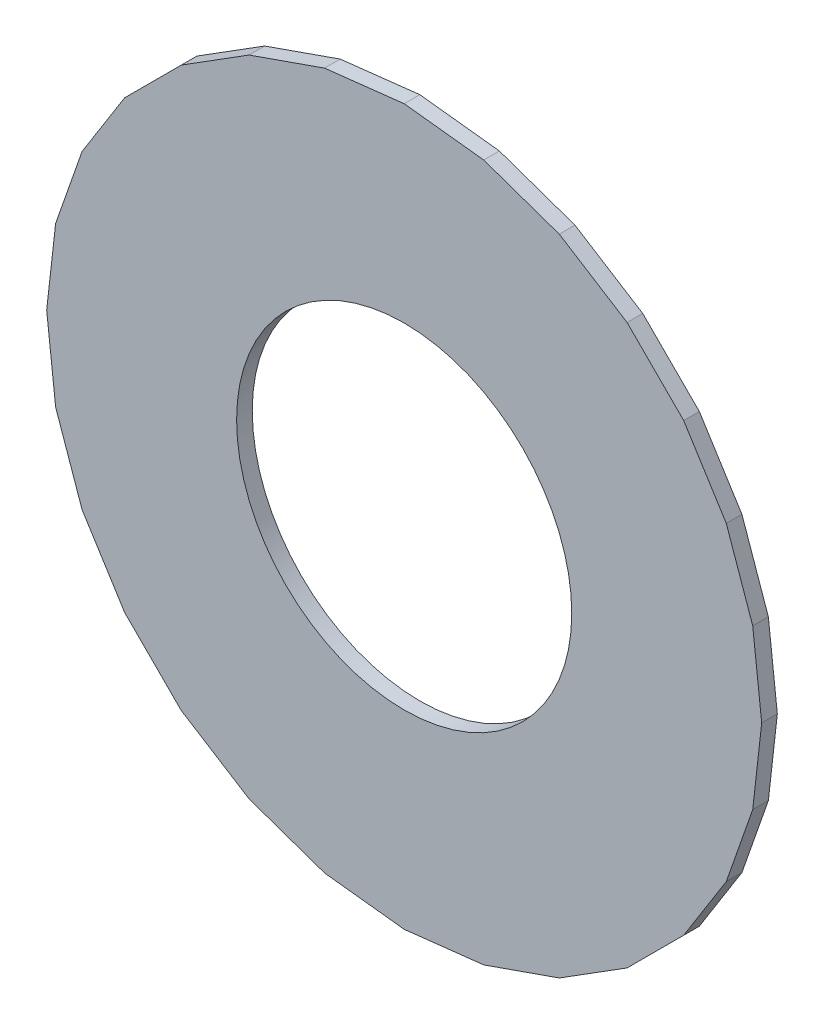
ISO-10303-21;
HEADER;
FILE_DESCRIPTION(('STEP AP214'),'2;1');
FILE_NAME('part.step','',(''),(''),'','','');
FILE_SCHEMA(('AUTOMOTIVE_DESIGN { 1 0 10303 214 1 1 1 1 }'));
ENDSEC;
DATA;
#1=APPLICATION_CONTEXT('core data for automotive mechanical design processes');
#2=APPLICATION_PROTOCOL_DEFINITION('international standard','automotive_design',2000,#1);
#3=PRODUCT_CONTEXT('',#1,'mechanical');
#4=PRODUCT('Part','Part','',(#3));
#5=PRODUCT_RELATED_PRODUCT_CATEGORY('part','',(#4));
#6=PRODUCT_DEFINITION_FORMATION('','',#4);
#7=PRODUCT_DEFINITION_CONTEXT('part definition',#1,'design');
#8=PRODUCT_DEFINITION('design','',#6,#7);
#9=PRODUCT_DEFINITION_SHAPE('','',#8);
#10=(LENGTH_UNIT() NAMED_UNIT(*) SI_UNIT(.MILLI.,.METRE.));
#11=(NAMED_UNIT(*) PLANE_ANGLE_UNIT() SI_UNIT($,.RADIAN.));
#12=(NAMED_UNIT(*) SI_UNIT($,.STERADIAN.) SOLID_ANGLE_UNIT());
#13=UNCERTAINTY_MEASURE_WITH_UNIT(LENGTH_MEASURE(1.E-05),#10,'distance_accuracy_value','');
#14=(GEOMETRIC_REPRESENTATION_CONTEXT(3) GLOBAL_UNCERTAINTY_ASSIGNED_CONTEXT((#13)) GLOBAL_UNIT_ASSIGNED_CONTEXT((#10,
#11,#12)) REPRESENTATION_CONTEXT('',''));
#15=CARTESIAN_POINT('',(0.,0.,0.));
#16=DIRECTION('',(0.,0.,1.));
#17=DIRECTION('',(1.,0.,0.));
#18=AXIS2_PLACEMENT_3D('',#15,#16,#17);
#19=CARTESIAN_POINT('',(166.497,-143.637,-0.045));
#20=DIRECTION('',(0.,0.,-1.));
#21=DIRECTION('',(0.,-1.,0.));
#22=AXIS2_PLACEMENT_3D('',#19,#20,#21);
#23=CYLINDRICAL_SURFACE('',#22,0.375);
#24=CARTESIAN_POINT('',(166.497,-143.637,1.67));
#25=DIRECTION('',(0.,0.,-1.));
#26=DIRECTION('',(0.,-1.,0.));
#27=AXIS2_PLACEMENT_3D('',#24,#25,#26);
#28=CIRCLE('',#27,0.375);
#29=CARTESIAN_POINT('',(166.497,-144.012,1.67));
#30=VERTEX_POINT('',#29);
#31=EDGE_CURVE('E475',#30,#30,#28,.T.);
#32=ORIENTED_EDGE('',*,*,#31,.T.);
#33=DIRECTION('',(0.,0.,1.));
#34=VECTOR('',#33,1.);
#35=CARTESIAN_POINT('',(166.497,-144.012,-0.045));
#36=LINE('',#35,#34);
#37=CARTESIAN_POINT('',(166.497,-144.012,1.705));
#38=VERTEX_POINT('',#37);
#39=EDGE_CURVE('E11',#30,#38,#36,.T.);
#40=ORIENTED_EDGE('',*,*,#39,.T.);
#41=CARTESIAN_POINT('',(166.497,-143.637,1.705));
#42=DIRECTION('',(0.,0.,-1.));
#43=DIRECTION('',(0.,-1.,0.));
#44=AXIS2_PLACEMENT_3D('',#41,#42,#43);
#45=CIRCLE('',#44,0.375);
#46=EDGE_CURVE('E551',#38,#38,#45,.T.);
#47=ORIENTED_EDGE('',*,*,#46,.F.);
#48=ORIENTED_EDGE('',*,*,#39,.F.);
#49=EDGE_LOOP('',(#32,#40,#47,#48));
#50=FACE_BOUND('',#49,.T.);
#51=ADVANCED_FACE('F17',(#50),#23,.F.);
#52=CARTESIAN_POINT('',(166.318983,-144.416942,1.67));
#53=DIRECTION('',(-0.330278315977027,-0.943883591337077,0.));
#54=DIRECTION('',(-0.943883591337077,0.330278315977027,0.));
#55=AXIS2_PLACEMENT_3D('',#52,#53,#54);
#56=PLANE('',#55);
#57=DIRECTION('',(0.,0.,1.));
#58=VECTOR('',#57,1.);
#59=CARTESIAN_POINT('',(166.318983,-144.416942,1.67));
#60=LINE('',#59,#58);
#61=CARTESIAN_POINT('',(166.318983,-144.416942,1.67));
#62=VERTEX_POINT('',#61);
#63=CARTESIAN_POINT('',(166.318983,-144.416942,1.705));
#64=VERTEX_POINT('',#63);
#65=EDGE_CURVE('E26',#62,#64,#60,.T.);
#66=ORIENTED_EDGE('',*,*,#65,.T.);
#67=DIRECTION('',(-0.943883591337077,0.330278315977027,0.));
#68=VECTOR('',#67,1.);
#69=CARTESIAN_POINT('',(166.318983,-144.416942,1.705));
#70=LINE('',#69,#68);
#71=CARTESIAN_POINT('',(166.149893,-144.357775,1.705));
#72=VERTEX_POINT('',#71);
#73=EDGE_CURVE('E334',#64,#72,#70,.T.);
#74=ORIENTED_EDGE('',*,*,#73,.T.);
#75=DIRECTION('',(0.,0.,1.));
#76=VECTOR('',#75,1.);
#77=CARTESIAN_POINT('',(166.149893,-144.357775,1.67));
#78=LINE('',#77,#76);
#79=CARTESIAN_POINT('',(166.149893,-144.357775,1.67));
#80=VERTEX_POINT('',#79);
#81=EDGE_CURVE('E434',#80,#72,#78,.T.);
#82=ORIENTED_EDGE('',*,*,#81,.F.);
#83=DIRECTION('',(-0.943883591337077,0.330278315977027,0.));
#84=VECTOR('',#83,1.);
#85=CARTESIAN_POINT('',(166.318983,-144.416942,1.67));
#86=LINE('',#85,#84);
#87=EDGE_CURVE('E429',#62,#80,#86,.T.);
#88=ORIENTED_EDGE('',*,*,#87,.F.);
#89=EDGE_LOOP('',(#66,#74,#82,#88));
#90=FACE_BOUND('',#89,.T.);
#91=ADVANCED_FACE('F616',(#90),#56,.T.);
#92=CARTESIAN_POINT('',(166.497,-144.437,1.67));
#93=DIRECTION('',(-0.111966136678988,-0.993712022789894,0.));
#94=DIRECTION('',(-0.993712022789894,0.111966136678988,0.));
#95=AXIS2_PLACEMENT_3D('',#92,#93,#94);
#96=PLANE('',#95);
#97=DIRECTION('',(0.,0.,1.));
#98=VECTOR('',#97,1.);
#99=CARTESIAN_POINT('',(166.497,-144.437,1.67));
#100=LINE('',#99,#98);
#101=CARTESIAN_POINT('',(166.497,-144.437,1.67));
#102=VERTEX_POINT('',#101);
#103=CARTESIAN_POINT('',(166.497,-144.437,1.705));
#104=VERTEX_POINT('',#103);
#105=EDGE_CURVE('E20',#102,#104,#100,.T.);
#106=ORIENTED_EDGE('',*,*,#105,.T.);
#107=DIRECTION('',(-0.993712022789894,0.111966136678988,0.));
#108=VECTOR('',#107,1.);
#109=CARTESIAN_POINT('',(166.497,-144.437,1.705));
#110=LINE('',#109,#108);
#111=EDGE_CURVE('E329',#104,#64,#110,.T.);
#112=ORIENTED_EDGE('',*,*,#111,.T.);
#113=ORIENTED_EDGE('',*,*,#65,.F.);
#114=DIRECTION('',(-0.993712022789894,0.111966136678988,0.));
#115=VECTOR('',#114,1.);
#116=CARTESIAN_POINT('',(166.497,-144.437,1.67));
#117=LINE('',#116,#115);
#118=EDGE_CURVE('E422',#102,#62,#117,.T.);
#119=ORIENTED_EDGE('',*,*,#118,.F.);
#120=EDGE_LOOP('',(#106,#112,#113,#119));
#121=FACE_BOUND('',#120,.T.);
#122=ADVANCED_FACE('F619',(#121),#96,.T.);
#123=CARTESIAN_POINT('',(166.149893,-144.357775,1.67));
#124=DIRECTION('',(-0.532032066600227,-0.846724205458361,0.));
#125=DIRECTION('',(-0.846724205458361,0.532032066600227,0.));
#126=AXIS2_PLACEMENT_3D('',#123,#124,#125);
#127=PLANE('',#126);
#128=ORIENTED_EDGE('',*,*,#81,.T.);
#129=DIRECTION('',(-0.846724205458361,0.532032066600227,0.));
#130=VECTOR('',#129,1.);
#131=CARTESIAN_POINT('',(166.149893,-144.357775,1.705));
#132=LINE('',#131,#130);
#133=CARTESIAN_POINT('',(165.998208,-144.262465,1.705));
#134=VERTEX_POINT('',#133);
#135=EDGE_CURVE('E482',#72,#134,#132,.T.);
#136=ORIENTED_EDGE('',*,*,#135,.T.);
#137=DIRECTION('',(0.,0.,1.));
#138=VECTOR('',#137,1.);
#139=CARTESIAN_POINT('',(165.998208,-144.262465,1.67));
#140=LINE('',#139,#138);
#141=CARTESIAN_POINT('',(165.998208,-144.262465,1.67));
#142=VERTEX_POINT('',#141);
#143=EDGE_CURVE('E534',#142,#134,#140,.T.);
#144=ORIENTED_EDGE('',*,*,#143,.F.);
#145=DIRECTION('',(-0.846724205458361,0.532032066600227,0.));
#146=VECTOR('',#145,1.);
#147=CARTESIAN_POINT('',(166.149893,-144.357775,1.67));
#148=LINE('',#147,#146);
#149=EDGE_CURVE('E433',#80,#142,#148,.T.);
#150=ORIENTED_EDGE('',*,*,#149,.F.);
#151=EDGE_LOOP('',(#128,#136,#144,#150));
#152=FACE_BOUND('',#151,.T.);
#153=ADVANCED_FACE('F611',(#152),#127,.T.);
#154=CARTESIAN_POINT('',(166.675017,-144.416942,1.67));
#155=DIRECTION('',(0.111966136678988,-0.993712022789894,0.));
#156=DIRECTION('',(0.,0.,-1.));
#157=AXIS2_PLACEMENT_3D('',#154,#155,#156);
#158=PLANE('',#157);
#159=DIRECTION('',(0.,0.,1.));
#160=VECTOR('',#159,1.);
#161=CARTESIAN_POINT('',(166.675017,-144.416942,1.67));
#162=LINE('',#161,#160);
#163=CARTESIAN_POINT('',(166.675017,-144.416942,1.67));
#164=VERTEX_POINT('',#163);
#165=CARTESIAN_POINT('',(166.675017,-144.416942,1.705));
#166=VERTEX_POINT('',#165);
#167=EDGE_CURVE('E537',#164,#166,#162,.T.);
#168=ORIENTED_EDGE('',*,*,#167,.T.);
#169=DIRECTION('',(-0.993712022789894,-0.111966136678988,0.));
#170=VECTOR('',#169,1.);
#171=CARTESIAN_POINT('',(166.675017,-144.416942,1.705));
#172=LINE('',#171,#170);
#173=EDGE_CURVE('E333',#166,#104,#172,.T.);
#174=ORIENTED_EDGE('',*,*,#173,.T.);
#175=ORIENTED_EDGE('',*,*,#105,.F.);
#176=DIRECTION('',(-0.993712022789894,-0.111966136678988,0.));
#177=VECTOR('',#176,1.);
#178=CARTESIAN_POINT('',(166.675017,-144.416942,1.67));
#179=LINE('',#178,#177);
#180=EDGE_CURVE('E413',#164,#102,#179,.T.);
#181=ORIENTED_EDGE('',*,*,#180,.F.);
#182=EDGE_LOOP('',(#168,#174,#175,#181));
#183=FACE_BOUND('',#182,.T.);
#184=ADVANCED_FACE('F623',(#183),#158,.T.);
#185=CARTESIAN_POINT('',(165.998208,-144.262465,1.67));
#186=DIRECTION('',(-0.707106781186048,-0.707106781187048,0.));
#187=DIRECTION('',(-0.707106781187048,0.707106781186048,0.));
#188=AXIS2_PLACEMENT_3D('',#185,#186,#187);
#189=PLANE('',#188);
#190=ORIENTED_EDGE('',*,*,#143,.T.);
#191=DIRECTION('',(-0.707106781187048,0.707106781186048,0.));
#192=VECTOR('',#191,1.);
#193=CARTESIAN_POINT('',(165.998208,-144.262465,1.705));
#194=LINE('',#193,#192);
#195=CARTESIAN_POINT('',(165.871535,-144.135792,1.705));
#196=VERTEX_POINT('',#195);
#197=EDGE_CURVE('E360',#134,#196,#194,.T.);
#198=ORIENTED_EDGE('',*,*,#197,.T.);
#199=DIRECTION('',(0.,0.,1.));
#200=VECTOR('',#199,1.);
#201=CARTESIAN_POINT('',(165.871535,-144.135792,1.67));
#202=LINE('',#201,#200);
#203=CARTESIAN_POINT('',(165.871535,-144.135792,1.67));
#204=VERTEX_POINT('',#203);
#205=EDGE_CURVE('E508',#204,#196,#202,.T.);
#206=ORIENTED_EDGE('',*,*,#205,.F.);
#207=DIRECTION('',(-0.707106781187048,0.707106781186048,0.));
#208=VECTOR('',#207,1.);
#209=CARTESIAN_POINT('',(165.998208,-144.262465,1.67));
#210=LINE('',#209,#208);
#211=EDGE_CURVE('E440',#142,#204,#210,.T.);
#212=ORIENTED_EDGE('',*,*,#211,.F.);
#213=EDGE_LOOP('',(#190,#198,#206,#212));
#214=FACE_BOUND('',#213,.T.);
#215=ADVANCED_FACE('F598',(#214),#189,.T.);
#216=CARTESIAN_POINT('',(166.844107,-144.357775,1.67));
#217=DIRECTION('',(0.330278315977027,-0.943883591337077,0.));
#218=DIRECTION('',(0.,0.,-1.));
#219=AXIS2_PLACEMENT_3D('',#216,#217,#218);
#220=PLANE('',#219);
#221=DIRECTION('',(0.,0.,1.));
#222=VECTOR('',#221,1.);
#223=CARTESIAN_POINT('',(166.844107,-144.357775,1.67));
#224=LINE('',#223,#222);
#225=CARTESIAN_POINT('',(166.844107,-144.357775,1.67));
#226=VERTEX_POINT('',#225);
#227=CARTESIAN_POINT('',(166.844107,-144.357775,1.705));
#228=VERTEX_POINT('',#227);
#229=EDGE_CURVE('E327',#226,#228,#224,.T.);
#230=ORIENTED_EDGE('',*,*,#229,.T.);
#231=DIRECTION('',(-0.943883591337077,-0.330278315977027,0.));
#232=VECTOR('',#231,1.);
#233=CARTESIAN_POINT('',(166.844107,-144.357775,1.705));
#234=LINE('',#233,#232);
#235=EDGE_CURVE('E523',#228,#166,#234,.T.);
#236=ORIENTED_EDGE('',*,*,#235,.T.);
#237=ORIENTED_EDGE('',*,*,#167,.F.);
#238=DIRECTION('',(-0.943883591337077,-0.330278315977027,0.));
#239=VECTOR('',#238,1.);
#240=CARTESIAN_POINT('',(166.844107,-144.357775,1.67));
#241=LINE('',#240,#239);
#242=EDGE_CURVE('E405',#226,#164,#241,.T.);
#243=ORIENTED_EDGE('',*,*,#242,.F.);
#244=EDGE_LOOP('',(#230,#236,#237,#243));
#245=FACE_BOUND('',#244,.T.);
#246=ADVANCED_FACE('F628',(#245),#220,.T.);
#247=CARTESIAN_POINT('',(165.871535,-144.135792,1.67));
#248=DIRECTION('',(-0.846724205458361,-0.532032066600227,0.));
#249=DIRECTION('',(-0.532032066600227,0.846724205458361,0.));
#250=AXIS2_PLACEMENT_3D('',#247,#248,#249);
#251=PLANE('',#250);
#252=ORIENTED_EDGE('',*,*,#205,.T.);
#253=DIRECTION('',(-0.532032066600227,0.846724205458361,0.));
#254=VECTOR('',#253,1.);
#255=CARTESIAN_POINT('',(165.871535,-144.135792,1.705));
#256=LINE('',#255,#254);
#257=CARTESIAN_POINT('',(165.776225,-143.984107,1.705));
#258=VERTEX_POINT('',#257);
#259=EDGE_CURVE('E356',#196,#258,#256,.T.);
#260=ORIENTED_EDGE('',*,*,#259,.T.);
#261=DIRECTION('',(0.,0.,1.));
#262=VECTOR('',#261,1.);
#263=CARTESIAN_POINT('',(165.776225,-143.984107,1.67));
#264=LINE('',#263,#262);
#265=CARTESIAN_POINT('',(165.776225,-143.984107,1.67));
#266=VERTEX_POINT('',#265);
#267=EDGE_CURVE('E324',#266,#258,#264,.T.);
#268=ORIENTED_EDGE('',*,*,#267,.F.);
#269=DIRECTION('',(-0.532032066600227,0.846724205458361,0.));
#270=VECTOR('',#269,1.);
#271=CARTESIAN_POINT('',(165.871535,-144.135792,1.67));
#272=LINE('',#271,#270);
#273=EDGE_CURVE('E448',#204,#266,#272,.T.);
#274=ORIENTED_EDGE('',*,*,#273,.F.);
#275=EDGE_LOOP('',(#252,#260,#268,#274));
#276=FACE_BOUND('',#275,.T.);
#277=ADVANCED_FACE('F592',(#276),#251,.T.);
#278=CARTESIAN_POINT('',(166.995792,-144.262465,1.67));
#279=DIRECTION('',(0.532032066600227,-0.846724205458361,0.));
#280=DIRECTION('',(0.,0.,-1.));
#281=AXIS2_PLACEMENT_3D('',#278,#279,#280);
#282=PLANE('',#281);
#283=DIRECTION('',(0.,0.,1.));
#284=VECTOR('',#283,1.);
#285=CARTESIAN_POINT('',(166.995792,-144.262465,1.67));
#286=LINE('',#285,#284);
#287=CARTESIAN_POINT('',(166.995792,-144.262465,1.67));
#288=VERTEX_POINT('',#287);
#289=CARTESIAN_POINT('',(166.995792,-144.262465,1.705));
#290=VERTEX_POINT('',#289);
#291=EDGE_CURVE('E328',#288,#290,#286,.T.);
#292=ORIENTED_EDGE('',*,*,#291,.T.);
#293=DIRECTION('',(-0.846724205458361,-0.532032066600227,0.));
#294=VECTOR('',#293,1.);
#295=CARTESIAN_POINT('',(166.995792,-144.262465,1.705));
#296=LINE('',#295,#294);
#297=EDGE_CURVE('E355',#290,#228,#296,.T.);
#298=ORIENTED_EDGE('',*,*,#297,.T.);
#299=ORIENTED_EDGE('',*,*,#229,.F.);
#300=DIRECTION('',(-0.846724205458361,-0.532032066600227,0.));
#301=VECTOR('',#300,1.);
#302=CARTESIAN_POINT('',(166.995792,-144.262465,1.67));
#303=LINE('',#302,#301);
#304=EDGE_CURVE('E397',#288,#226,#303,.T.);
#305=ORIENTED_EDGE('',*,*,#304,.F.);
#306=EDGE_LOOP('',(#292,#298,#299,#305));
#307=FACE_BOUND('',#306,.T.);
#308=ADVANCED_FACE('F632',(#307),#282,.T.);
#309=CARTESIAN_POINT('',(165.776225,-143.984107,1.67));
#310=DIRECTION('',(-0.943883591336766,-0.330278315977918,0.));
#311=DIRECTION('',(-0.330278315977918,0.943883591336766,0.));
#312=AXIS2_PLACEMENT_3D('',#309,#310,#311);
#313=PLANE('',#312);
#314=ORIENTED_EDGE('',*,*,#267,.T.);
#315=DIRECTION('',(-0.330278315977918,0.943883591336766,0.));
#316=VECTOR('',#315,1.);
#317=CARTESIAN_POINT('',(165.776225,-143.984107,1.705));
#318=LINE('',#317,#316);
#319=CARTESIAN_POINT('',(165.717058,-143.815017,1.705));
#320=VERTEX_POINT('',#319);
#321=EDGE_CURVE('E361',#258,#320,#318,.T.);
#322=ORIENTED_EDGE('',*,*,#321,.T.);
#323=DIRECTION('',(0.,0.,1.));
#324=VECTOR('',#323,1.);
#325=CARTESIAN_POINT('',(165.717058,-143.815017,1.67));
#326=LINE('',#325,#324);
#327=CARTESIAN_POINT('',(165.717058,-143.815017,1.67));
#328=VERTEX_POINT('',#327);
#329=EDGE_CURVE('E425',#328,#320,#326,.T.);
#330=ORIENTED_EDGE('',*,*,#329,.F.);
#331=DIRECTION('',(-0.330278315977918,0.943883591336766,0.));
#332=VECTOR('',#331,1.);
#333=CARTESIAN_POINT('',(165.776225,-143.984107,1.67));
#334=LINE('',#333,#332);
#335=EDGE_CURVE('E452',#266,#328,#334,.T.);
#336=ORIENTED_EDGE('',*,*,#335,.F.);
#337=EDGE_LOOP('',(#314,#322,#330,#336));
#338=FACE_BOUND('',#337,.T.);
#339=ADVANCED_FACE('F605',(#338),#313,.T.);
#340=CARTESIAN_POINT('',(167.122465,-144.135792,1.67));
#341=DIRECTION('',(0.707106781186048,-0.707106781187048,0.));
#342=DIRECTION('',(0.,0.,-1.));
#343=AXIS2_PLACEMENT_3D('',#340,#341,#342);
#344=PLANE('',#343);
#345=DIRECTION('',(0.,0.,1.));
#346=VECTOR('',#345,1.);
#347=CARTESIAN_POINT('',(167.122465,-144.135792,1.67));
#348=LINE('',#347,#346);
#349=CARTESIAN_POINT('',(167.122465,-144.135792,1.67));
#350=VERTEX_POINT('',#349);
#351=CARTESIAN_POINT('',(167.122465,-144.135792,1.705));
#352=VERTEX_POINT('',#351);
#353=EDGE_CURVE('E583',#350,#352,#348,.T.);
#354=ORIENTED_EDGE('',*,*,#353,.T.);
#355=DIRECTION('',(-0.707106781187048,-0.707106781186048,0.));
#356=VECTOR('',#355,1.);
#357=CARTESIAN_POINT('',(167.122465,-144.135792,1.705));
#358=LINE('',#357,#356);
#359=EDGE_CURVE('E350',#352,#290,#358,.T.);
#360=ORIENTED_EDGE('',*,*,#359,.T.);
#361=ORIENTED_EDGE('',*,*,#291,.F.);
#362=DIRECTION('',(-0.707106781187048,-0.707106781186048,0.));
#363=VECTOR('',#362,1.);
#364=CARTESIAN_POINT('',(167.122465,-144.135792,1.67));
#365=LINE('',#364,#363);
#366=EDGE_CURVE('E393',#350,#288,#365,.T.);
#367=ORIENTED_EDGE('',*,*,#366,.F.);
#368=EDGE_LOOP('',(#354,#360,#361,#367));
#369=FACE_BOUND('',#368,.T.);
#370=ADVANCED_FACE('F635',(#369),#344,.T.);
#371=CARTESIAN_POINT('',(165.717058,-143.815017,1.67));
#372=DIRECTION('',(-0.993712022789894,-0.111966136678988,0.));
#373=DIRECTION('',(-0.111966136678988,0.993712022789894,0.));
#374=AXIS2_PLACEMENT_3D('',#371,#372,#373);
#375=PLANE('',#374);
#376=ORIENTED_EDGE('',*,*,#329,.T.);
#377=DIRECTION('',(-0.111966136678988,0.993712022789894,0.));
#378=VECTOR('',#377,1.);
#379=CARTESIAN_POINT('',(165.717058,-143.815017,1.705));
#380=LINE('',#379,#378);
#381=CARTESIAN_POINT('',(165.697,-143.637,1.705));
#382=VERTEX_POINT('',#381);
#383=EDGE_CURVE('E502',#320,#382,#380,.T.);
#384=ORIENTED_EDGE('',*,*,#383,.T.);
#385=DIRECTION('',(0.,0.,1.));
#386=VECTOR('',#385,1.);
#387=CARTESIAN_POINT('',(165.697,-143.637,1.67));
#388=LINE('',#387,#386);
#389=CARTESIAN_POINT('',(165.697,-143.637,1.67));
#390=VERTEX_POINT('',#389);
#391=EDGE_CURVE('E346',#390,#382,#388,.T.);
#392=ORIENTED_EDGE('',*,*,#391,.F.);
#393=DIRECTION('',(-0.111966136678988,0.993712022789894,0.));
#394=VECTOR('',#393,1.);
#395=CARTESIAN_POINT('',(165.717058,-143.815017,1.67));
#396=LINE('',#395,#394);
#397=EDGE_CURVE('E456',#328,#390,#396,.T.);
#398=ORIENTED_EDGE('',*,*,#397,.F.);
#399=EDGE_LOOP('',(#376,#384,#392,#398));
#400=FACE_BOUND('',#399,.T.);
#401=ADVANCED_FACE('F693',(#400),#375,.T.);
#402=CARTESIAN_POINT('',(167.217775,-143.984107,1.67));
#403=DIRECTION('',(0.846724205458361,-0.532032066600227,0.));
#404=DIRECTION('',(0.,0.,-1.));
#405=AXIS2_PLACEMENT_3D('',#402,#403,#404);
#406=PLANE('',#405);
#407=DIRECTION('',(0.,0.,1.));
#408=VECTOR('',#407,1.);
#409=CARTESIAN_POINT('',(167.217775,-143.984107,1.67));
#410=LINE('',#409,#408);
#411=CARTESIAN_POINT('',(167.217775,-143.984107,1.67));
#412=VERTEX_POINT('',#411);
#413=CARTESIAN_POINT('',(167.217775,-143.984107,1.705));
#414=VERTEX_POINT('',#413);
#415=EDGE_CURVE('E343',#412,#414,#410,.T.);
#416=ORIENTED_EDGE('',*,*,#415,.T.);
#417=DIRECTION('',(-0.532032066600227,-0.846724205458361,0.));
#418=VECTOR('',#417,1.);
#419=CARTESIAN_POINT('',(167.217775,-143.984107,1.705));
#420=LINE('',#419,#418);
#421=EDGE_CURVE('E354',#414,#352,#420,.T.);
#422=ORIENTED_EDGE('',*,*,#421,.T.);
#423=ORIENTED_EDGE('',*,*,#353,.F.);
#424=DIRECTION('',(-0.532032066600227,-0.846724205458361,0.));
#425=VECTOR('',#424,1.);
#426=CARTESIAN_POINT('',(167.217775,-143.984107,1.67));
#427=LINE('',#426,#425);
#428=EDGE_CURVE('E313',#412,#350,#427,.T.);
#429=ORIENTED_EDGE('',*,*,#428,.F.);
#430=EDGE_LOOP('',(#416,#422,#423,#429));
#431=FACE_BOUND('',#430,.T.);
#432=ADVANCED_FACE('F640',(#431),#406,.T.);
#433=CARTESIAN_POINT('',(165.697,-143.637,1.67));
#434=DIRECTION('',(-0.993712022789894,0.111966136678988,0.));
#435=DIRECTION('',(0.,0.,1.));
#436=AXIS2_PLACEMENT_3D('',#433,#434,#435);
#437=PLANE('',#436);
#438=ORIENTED_EDGE('',*,*,#391,.T.);
#439=DIRECTION('',(0.111966136678988,0.993712022789894,0.));
#440=VECTOR('',#439,1.);
#441=CARTESIAN_POINT('',(165.697,-143.637,1.705));
#442=LINE('',#441,#440);
#443=CARTESIAN_POINT('',(165.717058,-143.458983,1.705));
#444=VERTEX_POINT('',#443);
#445=EDGE_CURVE('E498',#382,#444,#442,.T.);
#446=ORIENTED_EDGE('',*,*,#445,.T.);
#447=DIRECTION('',(0.,0.,1.));
#448=VECTOR('',#447,1.);
#449=CARTESIAN_POINT('',(165.717058,-143.458983,1.67));
#450=LINE('',#449,#448);
#451=CARTESIAN_POINT('',(165.717058,-143.458983,1.67));
#452=VERTEX_POINT('',#451);
#453=EDGE_CURVE('E347',#452,#444,#450,.T.);
#454=ORIENTED_EDGE('',*,*,#453,.F.);
#455=DIRECTION('',(0.111966136678988,0.993712022789894,0.));
#456=VECTOR('',#455,1.);
#457=CARTESIAN_POINT('',(165.697,-143.637,1.67));
#458=LINE('',#457,#456);
#459=EDGE_CURVE('E409',#390,#452,#458,.T.);
#460=ORIENTED_EDGE('',*,*,#459,.F.);
#461=EDGE_LOOP('',(#438,#446,#454,#460));
#462=FACE_BOUND('',#461,.T.);
#463=ADVANCED_FACE('F690',(#462),#437,.T.);
#464=CARTESIAN_POINT('',(167.276942,-143.815017,1.67));
#465=DIRECTION('',(0.943883591336766,-0.330278315977918,0.));
#466=DIRECTION('',(0.,0.,-1.));
#467=AXIS2_PLACEMENT_3D('',#464,#465,#466);
#468=PLANE('',#467);
#469=DIRECTION('',(0.,0.,1.));
#470=VECTOR('',#469,1.);
#471=CARTESIAN_POINT('',(167.276942,-143.815017,1.67));
#472=LINE('',#471,#470);
#473=CARTESIAN_POINT('',(167.276942,-143.815017,1.67));
#474=VERTEX_POINT('',#473);
#475=CARTESIAN_POINT('',(167.276942,-143.815017,1.705));
#476=VERTEX_POINT('',#475);
#477=EDGE_CURVE('E398',#474,#476,#472,.T.);
#478=ORIENTED_EDGE('',*,*,#477,.T.);
#479=DIRECTION('',(-0.330278315977918,-0.943883591336766,0.));
#480=VECTOR('',#479,1.);
#481=CARTESIAN_POINT('',(167.276942,-143.815017,1.705));
#482=LINE('',#481,#480);
#483=EDGE_CURVE('E533',#476,#414,#482,.T.);
#484=ORIENTED_EDGE('',*,*,#483,.T.);
#485=ORIENTED_EDGE('',*,*,#415,.F.);
#486=DIRECTION('',(-0.330278315977918,-0.943883591336766,0.));
#487=VECTOR('',#486,1.);
#488=CARTESIAN_POINT('',(167.276942,-143.815017,1.67));
#489=LINE('',#488,#487);
#490=EDGE_CURVE('E366',#474,#412,#489,.T.);
#491=ORIENTED_EDGE('',*,*,#490,.F.);
#492=EDGE_LOOP('',(#478,#484,#485,#491));
#493=FACE_BOUND('',#492,.T.);
#494=ADVANCED_FACE('F645',(#493),#468,.T.);
#495=CARTESIAN_POINT('',(165.717058,-143.458983,1.67));
#496=DIRECTION('',(-0.943883591336766,0.330278315977918,0.));
#497=DIRECTION('',(0.,0.,1.));
#498=AXIS2_PLACEMENT_3D('',#495,#496,#497);
#499=PLANE('',#498);
#500=ORIENTED_EDGE('',*,*,#453,.T.);
#501=DIRECTION('',(0.330278315977918,0.943883591336766,0.));
#502=VECTOR('',#501,1.);
#503=CARTESIAN_POINT('',(165.717058,-143.458983,1.705));
#504=LINE('',#503,#502);
#505=CARTESIAN_POINT('',(165.776225,-143.289893,1.705));
#506=VERTEX_POINT('',#505);
#507=EDGE_CURVE('E494',#444,#506,#504,.T.);
#508=ORIENTED_EDGE('',*,*,#507,.T.);
#509=DIRECTION('',(0.,0.,1.));
#510=VECTOR('',#509,1.);
#511=CARTESIAN_POINT('',(165.776225,-143.289893,1.67));
#512=LINE('',#511,#510);
#513=CARTESIAN_POINT('',(165.776225,-143.289893,1.67));
#514=VERTEX_POINT('',#513);
#515=EDGE_CURVE('E401',#514,#506,#512,.T.);
#516=ORIENTED_EDGE('',*,*,#515,.F.);
#517=DIRECTION('',(0.330278315977918,0.943883591336766,0.));
#518=VECTOR('',#517,1.);
#519=CARTESIAN_POINT('',(165.717058,-143.458983,1.67));
#520=LINE('',#519,#518);
#521=EDGE_CURVE('E340',#452,#514,#520,.T.);
#522=ORIENTED_EDGE('',*,*,#521,.F.);
#523=EDGE_LOOP('',(#500,#508,#516,#522));
#524=FACE_BOUND('',#523,.T.);
#525=ADVANCED_FACE('F686',(#524),#499,.T.);
#526=CARTESIAN_POINT('',(167.297,-143.637,1.67));
#527=DIRECTION('',(0.993712022789894,-0.111966136678988,0.));
#528=DIRECTION('',(0.,0.,-1.));
#529=AXIS2_PLACEMENT_3D('',#526,#527,#528);
#530=PLANE('',#529);
#531=DIRECTION('',(0.,0.,1.));
#532=VECTOR('',#531,1.);
#533=CARTESIAN_POINT('',(167.297,-143.637,1.67));
#534=LINE('',#533,#532);
#535=CARTESIAN_POINT('',(167.297,-143.637,1.67));
#536=VERTEX_POINT('',#535);
#537=CARTESIAN_POINT('',(167.297,-143.637,1.705));
#538=VERTEX_POINT('',#537);
#539=EDGE_CURVE('E490',#536,#538,#534,.T.);
#540=ORIENTED_EDGE('',*,*,#539,.T.);
#541=DIRECTION('',(-0.111966136678988,-0.993712022789894,0.));
#542=VECTOR('',#541,1.);
#543=CARTESIAN_POINT('',(167.297,-143.637,1.705));
#544=LINE('',#543,#542);
#545=EDGE_CURVE('E543',#538,#476,#544,.T.);
#546=ORIENTED_EDGE('',*,*,#545,.T.);
#547=ORIENTED_EDGE('',*,*,#477,.F.);
#548=DIRECTION('',(-0.111966136678988,-0.993712022789894,0.));
#549=VECTOR('',#548,1.);
#550=CARTESIAN_POINT('',(167.297,-143.637,1.67));
#551=LINE('',#550,#549);
#552=EDGE_CURVE('E370',#536,#474,#551,.T.);
#553=ORIENTED_EDGE('',*,*,#552,.F.);
#554=EDGE_LOOP('',(#540,#546,#547,#553));
#555=FACE_BOUND('',#554,.T.);
#556=ADVANCED_FACE('F648',(#555),#530,.T.);
#557=CARTESIAN_POINT('',(165.776225,-143.289893,1.67));
#558=DIRECTION('',(-0.846724205458361,0.532032066600227,0.));
#559=DIRECTION('',(0.,0.,1.));
#560=AXIS2_PLACEMENT_3D('',#557,#558,#559);
#561=PLANE('',#560);
#562=ORIENTED_EDGE('',*,*,#515,.T.);
#563=DIRECTION('',(0.532032066600227,0.846724205458361,0.));
#564=VECTOR('',#563,1.);
#565=CARTESIAN_POINT('',(165.776225,-143.289893,1.705));
#566=LINE('',#565,#564);
#567=CARTESIAN_POINT('',(165.871535,-143.138208,1.705));
#568=VERTEX_POINT('',#567);
#569=EDGE_CURVE('E319',#506,#568,#566,.T.);
#570=ORIENTED_EDGE('',*,*,#569,.T.);
#571=DIRECTION('',(0.,0.,1.));
#572=VECTOR('',#571,1.);
#573=CARTESIAN_POINT('',(165.871535,-143.138208,1.67));
#574=LINE('',#573,#572);
#575=CARTESIAN_POINT('',(165.871535,-143.138208,1.67));
#576=VERTEX_POINT('',#575);
#577=EDGE_CURVE('E566',#576,#568,#574,.T.);
#578=ORIENTED_EDGE('',*,*,#577,.F.);
#579=DIRECTION('',(0.532032066600227,0.846724205458361,0.));
#580=VECTOR('',#579,1.);
#581=CARTESIAN_POINT('',(165.776225,-143.289893,1.67));
#582=LINE('',#581,#580);
#583=EDGE_CURVE('E335',#514,#576,#582,.T.);
#584=ORIENTED_EDGE('',*,*,#583,.F.);
#585=EDGE_LOOP('',(#562,#570,#578,#584));
#586=FACE_BOUND('',#585,.T.);
#587=ADVANCED_FACE('F683',(#586),#561,.T.);
#588=CARTESIAN_POINT('',(167.276942,-143.458983,1.67));
#589=DIRECTION('',(0.993712022789894,0.111966136678988,0.));
#590=DIRECTION('',(0.,0.,-1.));
#591=AXIS2_PLACEMENT_3D('',#588,#589,#590);
#592=PLANE('',#591);
#593=DIRECTION('',(0.,0.,1.));
#594=VECTOR('',#593,1.);
#595=CARTESIAN_POINT('',(167.276942,-143.458983,1.67));
#596=LINE('',#595,#594);
#597=CARTESIAN_POINT('',(167.276942,-143.458983,1.67));
#598=VERTEX_POINT('',#597);
#599=CARTESIAN_POINT('',(167.276942,-143.458983,1.705));
#600=VERTEX_POINT('',#599);
#601=EDGE_CURVE('E578',#598,#600,#596,.T.);
#602=ORIENTED_EDGE('',*,*,#601,.T.);
#603=DIRECTION('',(0.111966136678988,-0.993712022789894,0.));
#604=VECTOR('',#603,1.);
#605=CARTESIAN_POINT('',(167.276942,-143.458983,1.705));
#606=LINE('',#605,#604);
#607=EDGE_CURVE('E546',#600,#538,#606,.T.);
#608=ORIENTED_EDGE('',*,*,#607,.T.);
#609=ORIENTED_EDGE('',*,*,#539,.F.);
#610=DIRECTION('',(0.111966136678988,-0.993712022789894,0.));
#611=VECTOR('',#610,1.);
#612=CARTESIAN_POINT('',(167.276942,-143.458983,1.67));
#613=LINE('',#612,#611);
#614=EDGE_CURVE('E374',#598,#536,#613,.T.);
#615=ORIENTED_EDGE('',*,*,#614,.F.);
#616=EDGE_LOOP('',(#602,#608,#609,#615));
#617=FACE_BOUND('',#616,.T.);
#618=ADVANCED_FACE('F653',(#617),#592,.T.);
#619=CARTESIAN_POINT('',(165.871535,-143.138208,1.67));
#620=DIRECTION('',(-0.707106781186048,0.707106781187048,0.));
#621=DIRECTION('',(0.,0.,1.));
#622=AXIS2_PLACEMENT_3D('',#619,#620,#621);
#623=PLANE('',#622);
#624=ORIENTED_EDGE('',*,*,#577,.T.);
#625=DIRECTION('',(0.707106781187048,0.707106781186048,0.));
#626=VECTOR('',#625,1.);
#627=CARTESIAN_POINT('',(165.871535,-143.138208,1.705));
#628=LINE('',#627,#626);
#629=CARTESIAN_POINT('',(165.998208,-143.011535,1.705));
#630=VERTEX_POINT('',#629);
#631=EDGE_CURVE('E316',#568,#630,#628,.T.);
#632=ORIENTED_EDGE('',*,*,#631,.T.);
#633=DIRECTION('',(0.,0.,1.));
#634=VECTOR('',#633,1.);
#635=CARTESIAN_POINT('',(165.998208,-143.011535,1.67));
#636=LINE('',#635,#634);
#637=CARTESIAN_POINT('',(165.998208,-143.011535,1.67));
#638=VERTEX_POINT('',#637);
#639=EDGE_CURVE('E575',#638,#630,#636,.T.);
#640=ORIENTED_EDGE('',*,*,#639,.F.);
#641=DIRECTION('',(0.707106781187048,0.707106781186048,0.));
#642=VECTOR('',#641,1.);
#643=CARTESIAN_POINT('',(165.871535,-143.138208,1.67));
#644=LINE('',#643,#642);
#645=EDGE_CURVE('E339',#576,#638,#644,.T.);
#646=ORIENTED_EDGE('',*,*,#645,.F.);
#647=EDGE_LOOP('',(#624,#632,#640,#646));
#648=FACE_BOUND('',#647,.T.);
#649=ADVANCED_FACE('F680',(#648),#623,.T.);
#650=CARTESIAN_POINT('',(167.217775,-143.289893,1.67));
#651=DIRECTION('',(0.943883591336766,0.330278315977918,0.));
#652=DIRECTION('',(0.,0.,-1.));
#653=AXIS2_PLACEMENT_3D('',#650,#651,#652);
#654=PLANE('',#653);
#655=DIRECTION('',(0.,0.,1.));
#656=VECTOR('',#655,1.);
#657=CARTESIAN_POINT('',(167.217775,-143.289893,1.67));
#658=LINE('',#657,#656);
#659=CARTESIAN_POINT('',(167.217775,-143.289893,1.67));
#660=VERTEX_POINT('',#659);
#661=CARTESIAN_POINT('',(167.217775,-143.289893,1.705));
#662=VERTEX_POINT('',#661);
#663=EDGE_CURVE('E572',#660,#662,#658,.T.);
#664=ORIENTED_EDGE('',*,*,#663,.T.);
#665=DIRECTION('',(0.330278315977918,-0.943883591336766,0.));
#666=VECTOR('',#665,1.);
#667=CARTESIAN_POINT('',(167.217775,-143.289893,1.705));
#668=LINE('',#667,#666);
#669=EDGE_CURVE('E418',#662,#600,#668,.T.);
#670=ORIENTED_EDGE('',*,*,#669,.T.);
#671=ORIENTED_EDGE('',*,*,#601,.F.);
#672=DIRECTION('',(0.330278315977918,-0.943883591336766,0.));
#673=VECTOR('',#672,1.);
#674=CARTESIAN_POINT('',(167.217775,-143.289893,1.67));
#675=LINE('',#674,#673);
#676=EDGE_CURVE('E385',#660,#598,#675,.T.);
#677=ORIENTED_EDGE('',*,*,#676,.F.);
#678=EDGE_LOOP('',(#664,#670,#671,#677));
#679=FACE_BOUND('',#678,.T.);
#680=ADVANCED_FACE('F657',(#679),#654,.T.);
#681=CARTESIAN_POINT('',(165.998208,-143.011535,1.67));
#682=DIRECTION('',(-0.532032066600227,0.846724205458361,0.));
#683=DIRECTION('',(0.,0.,1.));
#684=AXIS2_PLACEMENT_3D('',#681,#682,#683);
#685=PLANE('',#684);
#686=ORIENTED_EDGE('',*,*,#639,.T.);
#687=DIRECTION('',(0.846724205458361,0.532032066600227,0.));
#688=VECTOR('',#687,1.);
#689=CARTESIAN_POINT('',(165.998208,-143.011535,1.705));
#690=LINE('',#689,#688);
#691=CARTESIAN_POINT('',(166.149893,-142.916225,1.705));
#692=VERTEX_POINT('',#691);
#693=EDGE_CURVE('E320',#630,#692,#690,.T.);
#694=ORIENTED_EDGE('',*,*,#693,.T.);
#695=DIRECTION('',(0.,0.,1.));
#696=VECTOR('',#695,1.);
#697=CARTESIAN_POINT('',(166.149893,-142.916225,1.67));
#698=LINE('',#697,#696);
#699=CARTESIAN_POINT('',(166.149893,-142.916225,1.67));
#700=VERTEX_POINT('',#699);
#701=EDGE_CURVE('E569',#700,#692,#698,.T.);
#702=ORIENTED_EDGE('',*,*,#701,.F.);
#703=DIRECTION('',(0.846724205458361,0.532032066600227,0.));
#704=VECTOR('',#703,1.);
#705=CARTESIAN_POINT('',(165.998208,-143.011535,1.67));
#706=LINE('',#705,#704);
#707=EDGE_CURVE('E466',#638,#700,#706,.T.);
#708=ORIENTED_EDGE('',*,*,#707,.F.);
#709=EDGE_LOOP('',(#686,#694,#702,#708));
#710=FACE_BOUND('',#709,.T.);
#711=ADVANCED_FACE('F676',(#710),#685,.T.);
#712=CARTESIAN_POINT('',(167.122465,-143.138208,1.67));
#713=DIRECTION('',(0.846724205458361,0.532032066600227,0.));
#714=DIRECTION('',(0.,0.,-1.));
#715=AXIS2_PLACEMENT_3D('',#712,#713,#714);
#716=PLANE('',#715);
#717=DIRECTION('',(0.,0.,1.));
#718=VECTOR('',#717,1.);
#719=CARTESIAN_POINT('',(167.122465,-143.138208,1.67));
#720=LINE('',#719,#718);
#721=CARTESIAN_POINT('',(167.122465,-143.138208,1.67));
#722=VERTEX_POINT('',#721);
#723=CARTESIAN_POINT('',(167.122465,-143.138208,1.705));
#724=VERTEX_POINT('',#723);
#725=EDGE_CURVE('E47',#722,#724,#720,.T.);
#726=ORIENTED_EDGE('',*,*,#725,.T.);
#727=DIRECTION('',(0.532032066600227,-0.846724205458361,0.));
#728=VECTOR('',#727,1.);
#729=CARTESIAN_POINT('',(167.122465,-143.138208,1.705));
#730=LINE('',#729,#728);
#731=EDGE_CURVE('E414',#724,#662,#730,.T.);
#732=ORIENTED_EDGE('',*,*,#731,.T.);
#733=ORIENTED_EDGE('',*,*,#663,.F.);
#734=DIRECTION('',(0.532032066600227,-0.846724205458361,0.));
#735=VECTOR('',#734,1.);
#736=CARTESIAN_POINT('',(167.122465,-143.138208,1.67));
#737=LINE('',#736,#735);
#738=EDGE_CURVE('E386',#722,#660,#737,.T.);
#739=ORIENTED_EDGE('',*,*,#738,.F.);
#740=EDGE_LOOP('',(#726,#732,#733,#739));
#741=FACE_BOUND('',#740,.T.);
#742=ADVANCED_FACE('F658',(#741),#716,.T.);
#743=CARTESIAN_POINT('',(166.149893,-142.916225,1.67));
#744=DIRECTION('',(-0.330278315977027,0.943883591337077,0.));
#745=DIRECTION('',(0.,0.,1.));
#746=AXIS2_PLACEMENT_3D('',#743,#744,#745);
#747=PLANE('',#746);
#748=ORIENTED_EDGE('',*,*,#701,.T.);
#749=DIRECTION('',(0.943883591337077,0.330278315977027,0.));
#750=VECTOR('',#749,1.);
#751=CARTESIAN_POINT('',(166.149893,-142.916225,1.705));
#752=LINE('',#751,#750);
#753=CARTESIAN_POINT('',(166.318983,-142.857058,1.705));
#754=VERTEX_POINT('',#753);
#755=EDGE_CURVE('E444',#692,#754,#752,.T.);
#756=ORIENTED_EDGE('',*,*,#755,.T.);
#757=DIRECTION('',(0.,0.,1.));
#758=VECTOR('',#757,1.);
#759=CARTESIAN_POINT('',(166.318983,-142.857058,1.67));
#760=LINE('',#759,#758);
#761=CARTESIAN_POINT('',(166.318983,-142.857058,1.67));
#762=VERTEX_POINT('',#761);
#763=EDGE_CURVE('E554',#762,#754,#760,.T.);
#764=ORIENTED_EDGE('',*,*,#763,.F.);
#765=DIRECTION('',(0.943883591337077,0.330278315977027,0.));
#766=VECTOR('',#765,1.);
#767=CARTESIAN_POINT('',(166.149893,-142.916225,1.67));
#768=LINE('',#767,#766);
#769=EDGE_CURVE('E470',#700,#762,#768,.T.);
#770=ORIENTED_EDGE('',*,*,#769,.F.);
#771=EDGE_LOOP('',(#748,#756,#764,#770));
#772=FACE_BOUND('',#771,.T.);
#773=ADVANCED_FACE('F671',(#772),#747,.T.);
#774=CARTESIAN_POINT('',(166.995792,-143.011535,1.67));
#775=DIRECTION('',(0.707106781186048,0.707106781187048,0.));
#776=DIRECTION('',(0.,0.,-1.));
#777=AXIS2_PLACEMENT_3D('',#774,#775,#776);
#778=PLANE('',#777);
#779=DIRECTION('',(0.,0.,1.));
#780=VECTOR('',#779,1.);
#781=CARTESIAN_POINT('',(166.995792,-143.011535,1.67));
#782=LINE('',#781,#780);
#783=CARTESIAN_POINT('',(166.995792,-143.011535,1.67));
#784=VERTEX_POINT('',#783);
#785=CARTESIAN_POINT('',(166.995792,-143.011535,1.705));
#786=VERTEX_POINT('',#785);
#787=EDGE_CURVE('E365',#784,#786,#782,.T.);
#788=ORIENTED_EDGE('',*,*,#787,.T.);
#789=DIRECTION('',(0.707106781187048,-0.707106781186048,0.));
#790=VECTOR('',#789,1.);
#791=CARTESIAN_POINT('',(166.995792,-143.011535,1.705));
#792=LINE('',#791,#790);
#793=EDGE_CURVE('E417',#786,#724,#792,.T.);
#794=ORIENTED_EDGE('',*,*,#793,.T.);
#795=ORIENTED_EDGE('',*,*,#725,.F.);
#796=DIRECTION('',(0.707106781187048,-0.707106781186048,0.));
#797=VECTOR('',#796,1.);
#798=CARTESIAN_POINT('',(166.995792,-143.011535,1.67));
#799=LINE('',#798,#797);
#800=EDGE_CURVE('E381',#784,#722,#799,.T.);
#801=ORIENTED_EDGE('',*,*,#800,.F.);
#802=EDGE_LOOP('',(#788,#794,#795,#801));
#803=FACE_BOUND('',#802,.T.);
#804=ADVANCED_FACE('F661',(#803),#778,.T.);
#805=CARTESIAN_POINT('',(166.318983,-142.857058,1.67));
#806=DIRECTION('',(-0.111966136678988,0.993712022789894,0.));
#807=DIRECTION('',(0.,0.,1.));
#808=AXIS2_PLACEMENT_3D('',#805,#806,#807);
#809=PLANE('',#808);
#810=ORIENTED_EDGE('',*,*,#763,.T.);
#811=DIRECTION('',(0.993712022789894,0.111966136678988,0.));
#812=VECTOR('',#811,1.);
#813=CARTESIAN_POINT('',(166.318983,-142.857058,1.705));
#814=LINE('',#813,#812);
#815=CARTESIAN_POINT('',(166.497,-142.837,1.705));
#816=VERTEX_POINT('',#815);
#817=EDGE_CURVE('E478',#754,#816,#814,.T.);
#818=ORIENTED_EDGE('',*,*,#817,.T.);
#819=DIRECTION('',(0.,0.,1.));
#820=VECTOR('',#819,1.);
#821=CARTESIAN_POINT('',(166.497,-142.837,1.67));
#822=LINE('',#821,#820);
#823=CARTESIAN_POINT('',(166.497,-142.837,1.67));
#824=VERTEX_POINT('',#823);
#825=EDGE_CURVE('E299',#824,#816,#822,.T.);
#826=ORIENTED_EDGE('',*,*,#825,.F.);
#827=DIRECTION('',(0.993712022789894,0.111966136678988,0.));
#828=VECTOR('',#827,1.);
#829=CARTESIAN_POINT('',(166.318983,-142.857058,1.67));
#830=LINE('',#829,#828);
#831=EDGE_CURVE('E282',#762,#824,#830,.T.);
#832=ORIENTED_EDGE('',*,*,#831,.F.);
#833=EDGE_LOOP('',(#810,#818,#826,#832));
#834=FACE_BOUND('',#833,.T.);
#835=ADVANCED_FACE('F668',(#834),#809,.T.);
#836=CARTESIAN_POINT('',(0.,0.,1.705));
#837=DIRECTION('',(0.,0.,1.));
#838=DIRECTION('',(1.,0.,0.));
#839=AXIS2_PLACEMENT_3D('',#836,#837,#838);
#840=PLANE('',#839);
#841=ORIENTED_EDGE('',*,*,#46,.T.);
#842=EDGE_LOOP('',(#841));
#843=FACE_BOUND('',#842,.T.);
#844=DIRECTION('',(0.943883591337077,-0.330278315977027,0.));
#845=VECTOR('',#844,1.);
#846=CARTESIAN_POINT('',(166.675017,-142.857058,1.705));
#847=LINE('',#846,#845);
#848=CARTESIAN_POINT('',(166.675017,-142.857058,1.705));
#849=VERTEX_POINT('',#848);
#850=CARTESIAN_POINT('',(166.844107,-142.916225,1.705));
#851=VERTEX_POINT('',#850);
#852=EDGE_CURVE('E305',#849,#851,#847,.T.);
#853=ORIENTED_EDGE('',*,*,#852,.F.);
#854=DIRECTION('',(0.993712022789894,-0.111966136678988,0.));
#855=VECTOR('',#854,1.);
#856=CARTESIAN_POINT('',(166.497,-142.837,1.705));
#857=LINE('',#856,#855);
#858=EDGE_CURVE('E289',#816,#849,#857,.T.);
#859=ORIENTED_EDGE('',*,*,#858,.F.);
#860=ORIENTED_EDGE('',*,*,#817,.F.);
#861=ORIENTED_EDGE('',*,*,#755,.F.);
#862=ORIENTED_EDGE('',*,*,#693,.F.);
#863=ORIENTED_EDGE('',*,*,#631,.F.);
#864=ORIENTED_EDGE('',*,*,#569,.F.);
#865=ORIENTED_EDGE('',*,*,#507,.F.);
#866=ORIENTED_EDGE('',*,*,#445,.F.);
#867=ORIENTED_EDGE('',*,*,#383,.F.);
#868=ORIENTED_EDGE('',*,*,#321,.F.);
#869=ORIENTED_EDGE('',*,*,#259,.F.);
#870=ORIENTED_EDGE('',*,*,#197,.F.);
#871=ORIENTED_EDGE('',*,*,#135,.F.);
#872=ORIENTED_EDGE('',*,*,#73,.F.);
#873=ORIENTED_EDGE('',*,*,#111,.F.);
#874=ORIENTED_EDGE('',*,*,#173,.F.);
#875=ORIENTED_EDGE('',*,*,#235,.F.);
#876=ORIENTED_EDGE('',*,*,#297,.F.);
#877=ORIENTED_EDGE('',*,*,#359,.F.);
#878=ORIENTED_EDGE('',*,*,#421,.F.);
#879=ORIENTED_EDGE('',*,*,#483,.F.);
#880=ORIENTED_EDGE('',*,*,#545,.F.);
#881=ORIENTED_EDGE('',*,*,#607,.F.);
#882=ORIENTED_EDGE('',*,*,#669,.F.);
#883=ORIENTED_EDGE('',*,*,#731,.F.);
#884=ORIENTED_EDGE('',*,*,#793,.F.);
#885=DIRECTION('',(0.846724205458361,-0.532032066600227,0.));
#886=VECTOR('',#885,1.);
#887=CARTESIAN_POINT('',(166.844107,-142.916225,1.705));
#888=LINE('',#887,#886);
#889=EDGE_CURVE('E288',#851,#786,#888,.T.);
#890=ORIENTED_EDGE('',*,*,#889,.F.);
#891=EDGE_LOOP('',(#853,#859,#860,#861,#862,#863,#864,#865,#866,#867,#868,#869,#870,#871,#872,
#873,#874,#875,#876,#877,#878,#879,#880,#881,#882,#883,#884,#890));
#892=FACE_BOUND('',#891,.T.);
#893=ADVANCED_FACE('F601',(#843,#892),#840,.T.);
#894=CARTESIAN_POINT('',(0.,0.,1.67));
#895=DIRECTION('',(0.,0.,1.));
#896=DIRECTION('',(1.,0.,0.));
#897=AXIS2_PLACEMENT_3D('',#894,#895,#896);
#898=PLANE('',#897);
#899=ORIENTED_EDGE('',*,*,#31,.F.);
#900=EDGE_LOOP('',(#899));
#901=FACE_BOUND('',#900,.T.);
#902=DIRECTION('',(0.846724205458361,-0.532032066600227,0.));
#903=VECTOR('',#902,1.);
#904=CARTESIAN_POINT('',(166.844107,-142.916225,1.67));
#905=LINE('',#904,#903);
#906=CARTESIAN_POINT('',(166.844107,-142.916225,1.67));
#907=VERTEX_POINT('',#906);
#908=EDGE_CURVE('E378',#907,#784,#905,.T.);
#909=ORIENTED_EDGE('',*,*,#908,.T.);
#910=ORIENTED_EDGE('',*,*,#800,.T.);
#911=ORIENTED_EDGE('',*,*,#738,.T.);
#912=ORIENTED_EDGE('',*,*,#676,.T.);
#913=ORIENTED_EDGE('',*,*,#614,.T.);
#914=ORIENTED_EDGE('',*,*,#552,.T.);
#915=ORIENTED_EDGE('',*,*,#490,.T.);
#916=ORIENTED_EDGE('',*,*,#428,.T.);
#917=ORIENTED_EDGE('',*,*,#366,.T.);
#918=ORIENTED_EDGE('',*,*,#304,.T.);
#919=ORIENTED_EDGE('',*,*,#242,.T.);
#920=ORIENTED_EDGE('',*,*,#180,.T.);
#921=ORIENTED_EDGE('',*,*,#118,.T.);
#922=ORIENTED_EDGE('',*,*,#87,.T.);
#923=ORIENTED_EDGE('',*,*,#149,.T.);
#924=ORIENTED_EDGE('',*,*,#211,.T.);
#925=ORIENTED_EDGE('',*,*,#273,.T.);
#926=ORIENTED_EDGE('',*,*,#335,.T.);
#927=ORIENTED_EDGE('',*,*,#397,.T.);
#928=ORIENTED_EDGE('',*,*,#459,.T.);
#929=ORIENTED_EDGE('',*,*,#521,.T.);
#930=ORIENTED_EDGE('',*,*,#583,.T.);
#931=ORIENTED_EDGE('',*,*,#645,.T.);
#932=ORIENTED_EDGE('',*,*,#707,.T.);
#933=ORIENTED_EDGE('',*,*,#769,.T.);
#934=ORIENTED_EDGE('',*,*,#831,.T.);
#935=DIRECTION('',(0.993712022789894,-0.111966136678988,0.));
#936=VECTOR('',#935,1.);
#937=CARTESIAN_POINT('',(166.497,-142.837,1.67));
#938=LINE('',#937,#936);
#939=CARTESIAN_POINT('',(166.675017,-142.857058,1.67));
#940=VERTEX_POINT('',#939);
#941=EDGE_CURVE('E274',#824,#940,#938,.T.);
#942=ORIENTED_EDGE('',*,*,#941,.T.);
#943=DIRECTION('',(0.943883591337077,-0.330278315977027,0.));
#944=VECTOR('',#943,1.);
#945=CARTESIAN_POINT('',(166.675017,-142.857058,1.67));
#946=LINE('',#945,#944);
#947=EDGE_CURVE('E278',#940,#907,#946,.T.);
#948=ORIENTED_EDGE('',*,*,#947,.T.);
#949=EDGE_LOOP('',(#909,#910,#911,#912,#913,#914,#915,#916,#917,#918,#919,#920,#921,#922,#923,
#924,#925,#926,#927,#928,#929,#930,#931,#932,#933,#934,#942,#948));
#950=FACE_BOUND('',#949,.T.);
#951=ADVANCED_FACE('F277',(#901,#950),#898,.F.);
#952=CARTESIAN_POINT('',(166.844107,-142.916225,1.67));
#953=DIRECTION('',(0.532032066600227,0.846724205458361,0.));
#954=DIRECTION('',(0.,0.,-1.));
#955=AXIS2_PLACEMENT_3D('',#952,#953,#954);
#956=PLANE('',#955);
#957=DIRECTION('',(0.,0.,1.));
#958=VECTOR('',#957,1.);
#959=CARTESIAN_POINT('',(166.844107,-142.916225,1.67));
#960=LINE('',#959,#958);
#961=EDGE_CURVE('E297',#907,#851,#960,.T.);
#962=ORIENTED_EDGE('',*,*,#961,.T.);
#963=ORIENTED_EDGE('',*,*,#889,.T.);
#964=ORIENTED_EDGE('',*,*,#787,.F.);
#965=ORIENTED_EDGE('',*,*,#908,.F.);
#966=EDGE_LOOP('',(#962,#963,#964,#965));
#967=FACE_BOUND('',#966,.T.);
#968=ADVANCED_FACE('F664',(#967),#956,.T.);
#969=CARTESIAN_POINT('',(166.497,-142.837,1.67));
#970=DIRECTION('',(0.111966136678988,0.993712022789894,0.));
#971=DIRECTION('',(0.,0.,-1.));
#972=AXIS2_PLACEMENT_3D('',#969,#970,#971);
#973=PLANE('',#972);
#974=ORIENTED_EDGE('',*,*,#825,.T.);
#975=ORIENTED_EDGE('',*,*,#858,.T.);
#976=DIRECTION('',(0.,0.,1.));
#977=VECTOR('',#976,1.);
#978=CARTESIAN_POINT('',(166.675017,-142.857058,1.67));
#979=LINE('',#978,#977);
#980=EDGE_CURVE('E295',#940,#849,#979,.T.);
#981=ORIENTED_EDGE('',*,*,#980,.F.);
#982=ORIENTED_EDGE('',*,*,#941,.F.);
#983=EDGE_LOOP('',(#974,#975,#981,#982));
#984=FACE_BOUND('',#983,.T.);
#985=ADVANCED_FACE('F301',(#984),#973,.T.);
#986=CARTESIAN_POINT('',(166.675017,-142.857058,1.67));
#987=DIRECTION('',(0.330278315977027,0.943883591337077,0.));
#988=DIRECTION('',(0.,0.,-1.));
#989=AXIS2_PLACEMENT_3D('',#986,#987,#988);
#990=PLANE('',#989);
#991=ORIENTED_EDGE('',*,*,#980,.T.);
#992=ORIENTED_EDGE('',*,*,#852,.T.);
#993=ORIENTED_EDGE('',*,*,#961,.F.);
#994=ORIENTED_EDGE('',*,*,#947,.F.);
#995=EDGE_LOOP('',(#991,#992,#993,#994));
#996=FACE_BOUND('',#995,.T.);
#997=ADVANCED_FACE('F293',(#996),#990,.T.);
#998=CLOSED_SHELL('',(#51,#91,#122,#153,#184,#215,#246,#277,#308,#339,#370,#401,#432,#463,#494,
#525,#556,#587,#618,#649,#680,#711,#742,#773,#804,#835,#893,#951,#968,#985,#997));
#999=MANIFOLD_SOLID_BREP('B1',#998);
#1000=ADVANCED_BREP_SHAPE_REPRESENTATION('',(#18,#999),#14);
#1001=SHAPE_DEFINITION_REPRESENTATION(#9,#1000);
ENDSEC;
END-ISO-10303-21;
